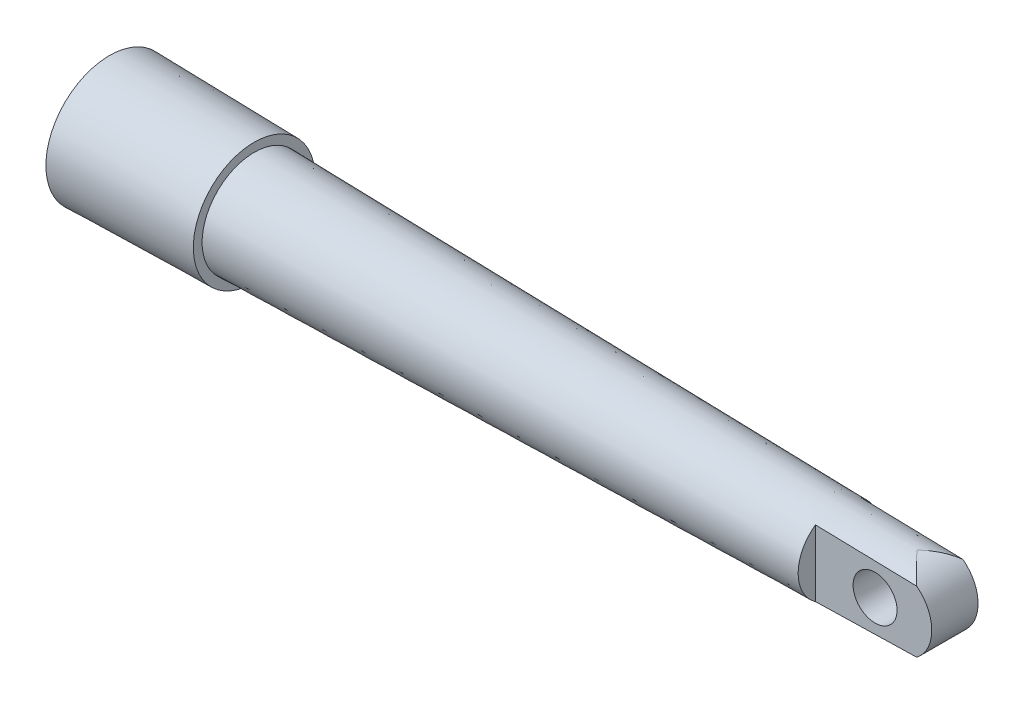
ISO-10303-21;
HEADER;
FILE_DESCRIPTION(('STEP AP214'),'2;1');
FILE_NAME('part.step','',(''),(''),'','','');
FILE_SCHEMA(('AUTOMOTIVE_DESIGN { 1 0 10303 214 1 1 1 1 }'));
ENDSEC;
DATA;
#1=APPLICATION_CONTEXT('core data for automotive mechanical design processes');
#2=APPLICATION_PROTOCOL_DEFINITION('international standard','automotive_design',2000,#1);
#3=PRODUCT_CONTEXT('',#1,'mechanical');
#4=PRODUCT('Part','Part','',(#3));
#5=PRODUCT_RELATED_PRODUCT_CATEGORY('part','',(#4));
#6=PRODUCT_DEFINITION_FORMATION('','',#4);
#7=PRODUCT_DEFINITION_CONTEXT('part definition',#1,'design');
#8=PRODUCT_DEFINITION('design','',#6,#7);
#9=PRODUCT_DEFINITION_SHAPE('','',#8);
#10=(LENGTH_UNIT() NAMED_UNIT(*) SI_UNIT(.MILLI.,.METRE.));
#11=(NAMED_UNIT(*) PLANE_ANGLE_UNIT() SI_UNIT($,.RADIAN.));
#12=(NAMED_UNIT(*) SI_UNIT($,.STERADIAN.) SOLID_ANGLE_UNIT());
#13=UNCERTAINTY_MEASURE_WITH_UNIT(LENGTH_MEASURE(1.E-05),#10,'distance_accuracy_value','');
#14=(GEOMETRIC_REPRESENTATION_CONTEXT(3) GLOBAL_UNCERTAINTY_ASSIGNED_CONTEXT((#13)) GLOBAL_UNIT_ASSIGNED_CONTEXT((#10,
#11,#12)) REPRESENTATION_CONTEXT('',''));
#15=CARTESIAN_POINT('',(0.,0.,0.));
#16=DIRECTION('',(0.,0.,1.));
#17=DIRECTION('',(1.,0.,0.));
#18=AXIS2_PLACEMENT_3D('',#15,#16,#17);
#19=CARTESIAN_POINT('',(174.200434656198,0.,5.));
#20=DIRECTION('',(0.,0.,-1.));
#21=DIRECTION('',(-1.,0.,0.));
#22=AXIS2_PLACEMENT_3D('',#19,#20,#21);
#23=CYLINDRICAL_SURFACE('',#22,8.41794246958896);
#24=CARTESIAN_POINT('',(179.366803439996,6.64608072559367,5.0002));
#25=CARTESIAN_POINT('',(179.259620876385,6.72939462139975,4.89298576343817));
#26=CARTESIAN_POINT('',(179.15121778174,6.80950832848228,4.78455001829458));
#27=CARTESIAN_POINT('',(178.932227068654,6.96346348707643,4.56549157156813));
#28=CARTESIAN_POINT('',(178.821639774893,7.03730586229762,4.4548691950252));
#29=CARTESIAN_POINT('',(178.487079278315,7.24956407380112,4.12019911741393));
#30=CARTESIAN_POINT('',(178.260171393543,7.37881592942518,3.89321236288996));
#31=CARTESIAN_POINT('',(177.801363349686,7.61322288873991,3.43423022190028));
#32=CARTESIAN_POINT('',(177.569488154344,7.7184768972235,3.20225986925533));
#33=CARTESIAN_POINT('',(177.101250731031,7.90636733326542,2.7337972823552));
#34=CARTESIAN_POINT('',(176.864889017503,7.98900633740341,2.49730556651675));
#35=CARTESIAN_POINT('',(176.43961571155,8.11702330295363,2.07174975260629));
#36=CARTESIAN_POINT('',(176.251320382807,8.16658860376487,1.88331260898278));
#37=CARTESIAN_POINT('',(175.873311813745,8.25232158124741,1.50488423674111));
#38=CARTESIAN_POINT('',(175.683598788161,8.28849124658635,1.31489324308571));
#39=CARTESIAN_POINT('',(175.297259563319,8.34853705658944,0.92781606930513));
#40=CARTESIAN_POINT('',(175.100602844277,8.37199297137441,0.730693944632489));
#41=CARTESIAN_POINT('',(174.824844994912,8.39513082891909,0.452540865957525));
#42=CARTESIAN_POINT('',(174.745433874348,8.40065380031897,0.372236261539609));
#43=CARTESIAN_POINT('',(174.625831059707,8.40728556893841,0.249265329173372));
#44=CARTESIAN_POINT('',(174.58518891933,8.40923877668969,0.207118522233076));
#45=CARTESIAN_POINT('',(174.524149916794,8.41174302874787,0.14076706652852));
#46=CARTESIAN_POINT('',(174.503030174873,8.41252599775226,0.117215222911022));
#47=CARTESIAN_POINT('',(174.472055028119,8.41356626360937,0.0784036573459711));
#48=CARTESIAN_POINT('',(174.461291683016,8.41390416527562,0.0639860149167651));
#49=CARTESIAN_POINT('',(174.449830312339,8.41424775595862,0.0436682692725535));
#50=CARTESIAN_POINT('',(174.44734618475,8.4143208275856,0.0388368240798795));
#51=CARTESIAN_POINT('',(174.443032102239,8.41444628863941,0.0288905928741298));
#52=CARTESIAN_POINT('',(174.441200278331,8.41449873720138,0.0237766656675212));
#53=CARTESIAN_POINT('',(174.438836485393,8.41456601034785,0.0144781546298814));
#54=CARTESIAN_POINT('',(174.438103551905,8.41458668149299,0.0103469902636856));
#55=CARTESIAN_POINT('',(174.437376768745,8.41460718158213,0.00202335230366073));
#56=CARTESIAN_POINT('',(174.437381556059,8.41460704896322,-0.00216899391449918));
#57=CARTESIAN_POINT('',(174.438122723688,8.41458613827413,-0.0104723514042981));
#58=CARTESIAN_POINT('',(174.438857065301,8.41456541773579,-0.0145835567703078));
#59=CARTESIAN_POINT('',(174.440921916264,8.41450666652898,-0.0226565569686138));
#60=CARTESIAN_POINT('',(174.442253894034,8.41446859322025,-0.0266179575697776));
#61=CARTESIAN_POINT('',(174.448105030095,8.41429926545655,-0.0413940451838804));
#62=CARTESIAN_POINT('',(174.454026262014,8.41412416787611,-0.0516213615028919));
#63=CARTESIAN_POINT('',(174.467034485339,8.41372247470663,-0.0713330370611939));
#64=CARTESIAN_POINT('',(174.474133087563,8.41349535662948,-0.0808084463831387));
#65=CARTESIAN_POINT('',(174.514657815897,8.41213981106812,-0.13258889336605));
#66=CARTESIAN_POINT('',(174.551926527026,8.41067871846851,-0.171796363214847));
#67=CARTESIAN_POINT('',(174.626444157955,8.40724364021028,-0.24958953422794));
#68=CARTESIAN_POINT('',(174.663692306371,8.40527216209481,-0.288177322106033));
#69=CARTESIAN_POINT('',(174.77586524311,8.39858017020571,-0.403323536696306));
#70=CARTESIAN_POINT('',(174.851328500491,8.39307853959255,-0.479381926215953));
#71=CARTESIAN_POINT('',(175.002233954241,8.38001611698356,-0.631336422771722));
#72=CARTESIAN_POINT('',(175.077676135822,8.37245465716117,-0.707232469116794));
#73=CARTESIAN_POINT('',(175.304322512078,8.34663338030185,-0.934935653003118));
#74=CARTESIAN_POINT('',(175.4555124713,8.32525640289347,-1.08642040076553));
#75=CARTESIAN_POINT('',(175.933483039656,8.24430007053753,-1.56517166582937));
#76=CARTESIAN_POINT('',(176.259106769756,8.1692626494769,-1.8911024028278));
#77=CARTESIAN_POINT('',(176.904678671959,7.97885339030716,-2.53713771585134));
#78=CARTESIAN_POINT('',(177.224624612471,7.86346604655091,-2.85724000230113));
#79=CARTESIAN_POINT('',(177.698024411462,7.65886698952587,-3.33084650398885));
#80=CARTESIAN_POINT('',(177.854911355188,7.5853133234466,-3.48779776945641));
#81=CARTESIAN_POINT('',(178.165959263709,7.42743465202846,-3.79896517150152));
#82=CARTESIAN_POINT('',(178.320120445948,7.34311051034524,-3.95318152625628));
#83=CARTESIAN_POINT('',(178.625315040644,7.1633504852728,-4.25848068881705));
#84=CARTESIAN_POINT('',(178.776346045375,7.06790639670477,-4.40956108457704));
#85=CARTESIAN_POINT('',(179.074598462207,6.86561794079729,-4.70790754928475));
#86=CARTESIAN_POINT('',(179.221818652435,6.75876997190451,-4.85517239485511));
#87=CARTESIAN_POINT('',(179.366803439996,6.64608072559368,-5.00019999999999));
#88=B_SPLINE_CURVE_WITH_KNOTS('',3,(#24,#25,#26,#27,#28,#29,#30,#31,#32,#33,#34,#35,#36,#37,#38,
#39,#40,#41,#42,#43,#44,#45,#46,#47,#48,#49,#50,#51,#52,#53,#54,#55,#56,#57,#58,#59,#60,#61,#62,
#63,#64,#65,#66,#67,#68,#69,#70,#71,#72,#73,#74,#75,#76,#77,#78,#79,#80,#81,#82,#83,#84,#85,#86,
#87),.UNSPECIFIED.,.F.,.F.,(4,2,2,2,2,2,2,2,2,2,2,2,2,2,2,2,2,2,2,2,2,2,2,2,2,2,2,2,2,2,2,4),
(0.,0.518870958801596,1.03766535965413,2.07459841268344,3.10717731854201,4.1396385312772,
4.95219239228514,5.76462557608318,6.60248834393434,6.94172070155679,7.11740483433382,
7.21237614199055,7.26609296600376,7.28236377254776,7.29858757743406,7.31111852431856,
7.32362631927253,7.33609925988377,7.3486030163793,7.3837617209358,7.4192903738709,
7.58118141317097,7.74229169101164,8.06402955937024,8.3858718642248,9.03098136231211,
10.429541653384,11.8286399741417,12.5297750168877,13.2308538727433,13.9324533561629,
14.6342750768479),.UNSPECIFIED.);
#89=CARTESIAN_POINT('',(179.366603499012,6.64623614603408,5.00000000000145));
#90=VERTEX_POINT('',#89);
#91=CARTESIAN_POINT('',(179.36660349901,6.64623614603521,-5.));
#92=VERTEX_POINT('',#91);
#93=EDGE_CURVE('E49',#90,#92,#88,.T.);
#94=ORIENTED_EDGE('',*,*,#93,.F.);
#95=CARTESIAN_POINT('',(174.200434656198,0.,5.));
#96=DIRECTION('',(0.,0.,1.));
#97=DIRECTION('',(-1.,0.,0.));
#98=AXIS2_PLACEMENT_3D('',#95,#96,#97);
#99=CIRCLE('',#98,8.41794246958896);
#100=CARTESIAN_POINT('',(179.36660349901,-6.6462361460352,5.));
#101=VERTEX_POINT('',#100);
#102=EDGE_CURVE('E107',#101,#90,#99,.T.);
#103=ORIENTED_EDGE('',*,*,#102,.F.);
#104=CARTESIAN_POINT('',(179.366803439996,-6.64608072559367,-5.0002));
#105=CARTESIAN_POINT('',(179.259620876385,-6.72939462139974,-4.89298576343817));
#106=CARTESIAN_POINT('',(179.15121778174,-6.80950832848227,-4.78455001829458));
#107=CARTESIAN_POINT('',(178.932227068654,-6.96346348707642,-4.56549157156814));
#108=CARTESIAN_POINT('',(178.821639774893,-7.0373058622976,-4.45486919502522));
#109=CARTESIAN_POINT('',(178.487079278315,-7.2495640738011,-4.12019911741395));
#110=CARTESIAN_POINT('',(178.260171393543,-7.37881592942516,-3.89321236288999));
#111=CARTESIAN_POINT('',(177.801363349686,-7.61322288873989,-3.43423022190032));
#112=CARTESIAN_POINT('',(177.569488154344,-7.71847689722348,-3.20225986925536));
#113=CARTESIAN_POINT('',(177.101250731031,-7.90636733326542,-2.73379728235522));
#114=CARTESIAN_POINT('',(176.864889017503,-7.98900633740341,-2.49730556651676));
#115=CARTESIAN_POINT('',(176.439615711544,-8.11702330295549,-2.07174975260012));
#116=CARTESIAN_POINT('',(176.251320382795,-8.16658860376813,-1.88331260897037));
#117=CARTESIAN_POINT('',(175.87331181372,-8.25232158125261,-1.50488423671615));
#118=CARTESIAN_POINT('',(175.68359878813,-8.28849124659209,-1.31489324305445));
#119=CARTESIAN_POINT('',(175.29725956329,-8.34853705659295,-0.927816069276641));
#120=CARTESIAN_POINT('',(175.100602844258,-8.37199297137625,-0.730693944613163));
#121=CARTESIAN_POINT('',(174.824844994904,-8.39513082891965,-0.452540865949615));
#122=CARTESIAN_POINT('',(174.745433874343,-8.40065380031932,-0.372236261533826));
#123=CARTESIAN_POINT('',(174.625831059704,-8.40728556893855,-0.249265329170245));
#124=CARTESIAN_POINT('',(174.585188919328,-8.40923877668978,-0.207118522230523));
#125=CARTESIAN_POINT('',(174.524149916792,-8.41174302874793,-0.140767066526929));
#126=CARTESIAN_POINT('',(174.503030174872,-8.41252599775231,-0.117215222909761));
#127=CARTESIAN_POINT('',(174.472055028119,-8.41356626360939,-0.0784036573449849));
#128=CARTESIAN_POINT('',(174.461291683015,-8.41390416527563,-0.0639860149157862));
#129=CARTESIAN_POINT('',(174.449830312339,-8.41424775595863,-0.0436682692717975));
#130=CARTESIAN_POINT('',(174.44734618475,-8.41432082758561,-0.038836824079214));
#131=CARTESIAN_POINT('',(174.443032102239,-8.41444628863941,-0.028890592873542));
#132=CARTESIAN_POINT('',(174.441200278331,-8.41449873720138,-0.0237766656669208));
#133=CARTESIAN_POINT('',(174.438836485393,-8.41456601034785,-0.0144781546292926));
#134=CARTESIAN_POINT('',(174.438103551905,-8.41458668149298,-0.0103469902630968));
#135=CARTESIAN_POINT('',(174.437376768746,-8.41460718158212,-0.0020233523030665));
#136=CARTESIAN_POINT('',(174.43738155606,-8.41460704896321,0.00216899391509886));
#137=CARTESIAN_POINT('',(174.438122723688,-8.41458613827412,0.0104723514049277));
#138=CARTESIAN_POINT('',(174.438857065301,-8.41456541773578,0.0145835567709619));
#139=CARTESIAN_POINT('',(174.440921916264,-8.41450666652898,0.02265655696928));
#140=CARTESIAN_POINT('',(174.442253894035,-8.41446859322025,0.0266179575704316));
#141=CARTESIAN_POINT('',(174.448105030096,-8.41429926545653,0.0413940451848976));
#142=CARTESIAN_POINT('',(174.454026262015,-8.41412416787608,0.0516213615042039));
#143=CARTESIAN_POINT('',(174.467034485341,-8.41372247470657,0.0713330370632448));
#144=CARTESIAN_POINT('',(174.474133087565,-8.41349535662942,0.0808084463856322));
#145=CARTESIAN_POINT('',(174.5146578159,-8.412139811068,0.132588893370765));
#146=CARTESIAN_POINT('',(174.551926527031,-8.41067871846829,0.171796363220818));
#147=CARTESIAN_POINT('',(174.626444157964,-8.40724364020984,0.249589534236728));
#148=CARTESIAN_POINT('',(174.663692306381,-8.40527216209425,0.288177322116378));
#149=CARTESIAN_POINT('',(174.775865243125,-8.39858017020473,0.403323536711294));
#150=CARTESIAN_POINT('',(174.851328500509,-8.3930785395912,0.479381926233949));
#151=CARTESIAN_POINT('',(175.002233954265,-8.3800161169813,0.631336422795774));
#152=CARTESIAN_POINT('',(175.077676135849,-8.37245465715837,0.707232469143893));
#153=CARTESIAN_POINT('',(175.304322512114,-8.34663338029717,0.934935653039459));
#154=CARTESIAN_POINT('',(175.455512471342,-8.32525640288719,1.08642040080804));
#155=CARTESIAN_POINT('',(175.933483039701,-8.24430007052799,1.56517166587413));
#156=CARTESIAN_POINT('',(176.259106769797,-8.16926264946646,1.89110240286867));
#157=CARTESIAN_POINT('',(176.904678671992,-7.97885339029579,2.53713771588447));
#158=CARTESIAN_POINT('',(177.2246246125,-7.86346604653949,2.85724000233039));
#159=CARTESIAN_POINT('',(177.698024411486,-7.65886698951522,3.33084650401206));
#160=CARTESIAN_POINT('',(177.854911355209,-7.58531332343644,3.4877977694774));
#161=CARTESIAN_POINT('',(178.165959263725,-7.42743465201955,3.79896517151812));
#162=CARTESIAN_POINT('',(178.320120445963,-7.34311051033708,3.95318152627072));
#163=CARTESIAN_POINT('',(178.625315040654,-7.16335048526646,4.25848068882723));
#164=CARTESIAN_POINT('',(178.776346045383,-7.06790639669949,4.4095610845851));
#165=CARTESIAN_POINT('',(179.074598462211,-6.86561794079441,4.7079075492887));
#166=CARTESIAN_POINT('',(179.221818652437,-6.75876997190299,4.85517239485707));
#167=CARTESIAN_POINT('',(179.366803439996,-6.64608072559366,5.00020000000001));
#168=B_SPLINE_CURVE_WITH_KNOTS('',3,(#104,#105,#106,#107,#108,#109,#110,#111,#112,#113,#114,
#115,#116,#117,#118,#119,#120,#121,#122,#123,#124,#125,#126,#127,#128,#129,#130,#131,#132,#133,
#134,#135,#136,#137,#138,#139,#140,#141,#142,#143,#144,#145,#146,#147,#148,#149,#150,#151,#152,
#153,#154,#155,#156,#157,#158,#159,#160,#161,#162,#163,#164,#165,#166,#167),.UNSPECIFIED.,.F.,
.F.,(4,2,2,2,2,2,2,2,2,2,2,2,2,2,2,2,2,2,2,2,2,2,2,2,2,2,2,2,2,2,2,4),(0.,0.518870958801591,
1.0376653596541,2.07459841268339,3.10717731854197,4.1396385312772,4.95219239231187,
5.76462557613664,6.60248834394841,6.94172070156193,7.11740483433632,7.2123761419918,
7.26609296600465,7.28236377254843,7.29858757743451,7.31111852431904,7.32362631927302,
7.33609925988429,7.34860301637983,7.38376172093774,7.41929037387437,7.58118141318107,
7.74229169102815,8.06402955939975,8.38587186426731,9.03098136238116,10.4295416534373,
11.8286399741792,12.5297750169158,13.2308538727621,13.9324533561721,14.6342750768478),.UNSPECIFIED.);
#169=CARTESIAN_POINT('',(179.36660349901,-6.64623614603521,-5.));
#170=VERTEX_POINT('',#169);
#171=EDGE_CURVE('E78',#170,#101,#168,.T.);
#172=ORIENTED_EDGE('',*,*,#171,.F.);
#173=CARTESIAN_POINT('',(174.200434656198,0.,-5.));
#174=DIRECTION('',(0.,0.,1.));
#175=DIRECTION('',(-1.,0.,0.));
#176=AXIS2_PLACEMENT_3D('',#173,#174,#175);
#177=CIRCLE('',#176,8.41794246958896);
#178=EDGE_CURVE('E83',#170,#92,#177,.T.);
#179=ORIENTED_EDGE('',*,*,#178,.T.);
#180=EDGE_LOOP('',(#94,#103,#172,#179));
#181=FACE_BOUND('',#180,.T.);
#182=ADVANCED_FACE('F33',(#181),#23,.T.);
#183=CARTESIAN_POINT('',(174.200434656198,0.,5.));
#184=DIRECTION('',(0.,0.,-1.));
#185=DIRECTION('',(-1.,0.,0.));
#186=AXIS2_PLACEMENT_3D('',#183,#184,#185);
#187=PLANE('',#186);
#188=CARTESIAN_POINT('',(170.368377125787,0.,5.));
#189=DIRECTION('',(0.,0.,1.));
#190=DIRECTION('',(1.,0.,0.));
#191=AXIS2_PLACEMENT_3D('',#188,#189,#190);
#192=CIRCLE('',#191,4.75);
#193=CARTESIAN_POINT('',(175.118377125787,0.,5.));
#194=VERTEX_POINT('',#193);
#195=EDGE_CURVE('E183',#194,#194,#192,.T.);
#196=ORIENTED_EDGE('',*,*,#195,.F.);
#197=EDGE_LOOP('',(#196));
#198=FACE_BOUND('',#197,.T.);
#199=CARTESIAN_POINT('',(143.620386068594,-7.5131755164153,5.));
#200=CARTESIAN_POINT('',(146.459216654679,-7.4456495044111,5.));
#201=CARTESIAN_POINT('',(149.298040658304,-7.37784630620775,5.));
#202=CARTESIAN_POINT('',(154.97567422518,-7.24163294133822,5.));
#203=CARTESIAN_POINT('',(157.814483788429,-7.17322277464566,5.));
#204=CARTESIAN_POINT('',(163.492086958253,-7.03574288245034,5.));
#205=CARTESIAN_POINT('',(166.330880564828,-6.96667315694623,5.));
#206=CARTESIAN_POINT('',(172.008450038264,-6.82781207334078,5.));
#207=CARTESIAN_POINT('',(174.847225905126,-6.75802071526119,5.));
#208=CARTESIAN_POINT('',(182.584603257201,-6.56672069814767,5.));
#209=CARTESIAN_POINT('',(187.483185485016,-6.44443142708481,5.));
#210=CARTESIAN_POINT('',(197.280279498378,-6.1970677290549,5.));
#211=CARTESIAN_POINT('',(202.178791283926,-6.07199330218287,5.));
#212=CARTESIAN_POINT('',(211.975731833362,-5.81851562167596,5.));
#213=CARTESIAN_POINT('',(216.8741605972,-5.69011236610296,5.));
#214=CARTESIAN_POINT('',(226.670909079756,-5.42917977386669,5.));
#215=CARTESIAN_POINT('',(231.569228798453,-5.29665043639243,5.));
#216=CARTESIAN_POINT('',(236.467481446118,-5.16165942084912,5.));
#217=B_SPLINE_CURVE_WITH_KNOTS('',3,(#199,#200,#201,#202,#203,#204,#205,#206,#207,#208,#209,
#210,#211,#212,#213,#214,#215,#216),.UNSPECIFIED.,.F.,.F.,(4,2,2,2,2,2,2,2,4),(0.,
8.51890073665628,17.0378018434508,25.5567029677891,34.0756038354551,48.7759283722273,
63.4762524075107,78.1765850017985,92.8769204854741),.UNSPECIFIED.);
#218=CARTESIAN_POINT('',(157.5,-7.18070330817253,5.));
#219=VERTEX_POINT('',#218);
#220=EDGE_CURVE('E73',#101,#219,#217,.F.);
#221=ORIENTED_EDGE('',*,*,#220,.F.);
#222=ORIENTED_EDGE('',*,*,#102,.T.);
#223=CARTESIAN_POINT('',(143.620386068594,7.51317551641531,5.));
#224=CARTESIAN_POINT('',(146.459216654679,7.44564950441111,5.));
#225=CARTESIAN_POINT('',(149.298040658304,7.37784630620776,5.));
#226=CARTESIAN_POINT('',(154.97567422518,7.24163294133822,5.));
#227=CARTESIAN_POINT('',(157.814483788429,7.17322277464566,5.));
#228=CARTESIAN_POINT('',(163.492086958253,7.03574288245035,5.));
#229=CARTESIAN_POINT('',(166.330880564828,6.96667315694623,5.));
#230=CARTESIAN_POINT('',(172.008450038264,6.82781207334078,5.));
#231=CARTESIAN_POINT('',(174.847225905126,6.75802071526119,5.));
#232=CARTESIAN_POINT('',(182.584603257201,6.56672069814767,5.));
#233=CARTESIAN_POINT('',(187.483185485016,6.44443142708481,5.));
#234=CARTESIAN_POINT('',(197.280279498378,6.1970677290549,5.));
#235=CARTESIAN_POINT('',(202.178791283926,6.07199330218287,5.));
#236=CARTESIAN_POINT('',(211.975731833362,5.81851562167595,5.));
#237=CARTESIAN_POINT('',(216.8741605972,5.69011236610296,5.));
#238=CARTESIAN_POINT('',(226.670909079756,5.42917977386669,5.));
#239=CARTESIAN_POINT('',(231.569228798453,5.29665043639242,5.));
#240=CARTESIAN_POINT('',(236.467481446118,5.16165942084912,5.));
#241=B_SPLINE_CURVE_WITH_KNOTS('',3,(#223,#224,#225,#226,#227,#228,#229,#230,#231,#232,#233,
#234,#235,#236,#237,#238,#239,#240),.UNSPECIFIED.,.F.,.F.,(4,2,2,2,2,2,2,2,4),(0.,
8.5189007366563,17.0378018434508,25.5567029677891,34.0756038354551,48.7759283722273,
63.4762524075107,78.1765850017984,92.8769204854741),.UNSPECIFIED.);
#242=CARTESIAN_POINT('',(157.5,7.18070330817253,5.));
#243=VERTEX_POINT('',#242);
#244=EDGE_CURVE('E92',#243,#90,#241,.T.);
#245=ORIENTED_EDGE('',*,*,#244,.F.);
#246=DIRECTION('',(0.,-1.,0.));
#247=VECTOR('',#246,1.);
#248=CARTESIAN_POINT('',(157.5,8.75,5.));
#249=LINE('',#248,#247);
#250=EDGE_CURVE('E87',#243,#219,#249,.T.);
#251=ORIENTED_EDGE('',*,*,#250,.T.);
#252=EDGE_LOOP('',(#221,#222,#245,#251));
#253=FACE_BOUND('',#252,.T.);
#254=ADVANCED_FACE('F91',(#198,#253),#187,.F.);
#255=CARTESIAN_POINT('',(174.200434656198,0.,-5.));
#256=DIRECTION('',(0.,0.,-1.));
#257=DIRECTION('',(-1.,0.,0.));
#258=AXIS2_PLACEMENT_3D('',#255,#256,#257);
#259=PLANE('',#258);
#260=CARTESIAN_POINT('',(170.368377125787,0.,-5.));
#261=DIRECTION('',(0.,0.,-1.));
#262=DIRECTION('',(-1.,0.,0.));
#263=AXIS2_PLACEMENT_3D('',#260,#261,#262);
#264=CIRCLE('',#263,4.75);
#265=CARTESIAN_POINT('',(165.618377125787,0.,-5.));
#266=VERTEX_POINT('',#265);
#267=EDGE_CURVE('E37',#266,#266,#264,.T.);
#268=ORIENTED_EDGE('',*,*,#267,.F.);
#269=EDGE_LOOP('',(#268));
#270=FACE_BOUND('',#269,.T.);
#271=ORIENTED_EDGE('',*,*,#178,.F.);
#272=CARTESIAN_POINT('',(143.620386068594,-7.5131755164153,-5.));
#273=CARTESIAN_POINT('',(146.459216654679,-7.4456495044111,-5.));
#274=CARTESIAN_POINT('',(149.298040658304,-7.37784630620775,-5.));
#275=CARTESIAN_POINT('',(154.97567422518,-7.24163294133822,-5.));
#276=CARTESIAN_POINT('',(157.814483788429,-7.17322277464566,-5.));
#277=CARTESIAN_POINT('',(163.492086958253,-7.03574288245034,-5.));
#278=CARTESIAN_POINT('',(166.330880564828,-6.96667315694623,-5.));
#279=CARTESIAN_POINT('',(172.008450038264,-6.82781207334078,-5.));
#280=CARTESIAN_POINT('',(174.847225905126,-6.75802071526119,-5.));
#281=CARTESIAN_POINT('',(182.584603257201,-6.56672069814767,-5.));
#282=CARTESIAN_POINT('',(187.483185485016,-6.44443142708481,-5.));
#283=CARTESIAN_POINT('',(197.280279498378,-6.1970677290549,-5.));
#284=CARTESIAN_POINT('',(202.178791283926,-6.07199330218287,-5.));
#285=CARTESIAN_POINT('',(211.975731833362,-5.81851562167596,-5.));
#286=CARTESIAN_POINT('',(216.8741605972,-5.69011236610296,-5.));
#287=CARTESIAN_POINT('',(226.670909079756,-5.42917977386669,-5.));
#288=CARTESIAN_POINT('',(231.569228798453,-5.29665043639243,-5.));
#289=CARTESIAN_POINT('',(236.467481446118,-5.16165942084912,-5.));
#290=B_SPLINE_CURVE_WITH_KNOTS('',3,(#272,#273,#274,#275,#276,#277,#278,#279,#280,#281,#282,
#283,#284,#285,#286,#287,#288,#289),.UNSPECIFIED.,.F.,.F.,(4,2,2,2,2,2,2,2,4),(0.,
8.51890073665628,17.0378018434508,25.5567029677891,34.0756038354551,48.7759283722273,
63.4762524075107,78.1765850017985,92.8769204854741),.UNSPECIFIED.);
#291=CARTESIAN_POINT('',(157.5,-7.18070330817254,-5.));
#292=VERTEX_POINT('',#291);
#293=EDGE_CURVE('E11',#170,#292,#290,.F.);
#294=ORIENTED_EDGE('',*,*,#293,.T.);
#295=DIRECTION('',(0.,-1.,0.));
#296=VECTOR('',#295,1.);
#297=CARTESIAN_POINT('',(157.5,8.75,-5.));
#298=LINE('',#297,#296);
#299=CARTESIAN_POINT('',(157.5,7.18070330817253,-5.));
#300=VERTEX_POINT('',#299);
#301=EDGE_CURVE('E93',#300,#292,#298,.T.);
#302=ORIENTED_EDGE('',*,*,#301,.F.);
#303=CARTESIAN_POINT('',(143.620386068594,7.51317551641531,-5.));
#304=CARTESIAN_POINT('',(146.459216654679,7.44564950441111,-5.));
#305=CARTESIAN_POINT('',(149.298040658304,7.37784630620776,-5.));
#306=CARTESIAN_POINT('',(154.97567422518,7.24163294133822,-5.));
#307=CARTESIAN_POINT('',(157.814483788429,7.17322277464566,-5.));
#308=CARTESIAN_POINT('',(163.492086958253,7.03574288245035,-5.));
#309=CARTESIAN_POINT('',(166.330880564828,6.96667315694623,-5.));
#310=CARTESIAN_POINT('',(172.008450038264,6.82781207334078,-5.));
#311=CARTESIAN_POINT('',(174.847225905126,6.75802071526119,-5.));
#312=CARTESIAN_POINT('',(182.584603257201,6.56672069814767,-5.));
#313=CARTESIAN_POINT('',(187.483185485016,6.44443142708481,-5.));
#314=CARTESIAN_POINT('',(197.280279498378,6.1970677290549,-5.));
#315=CARTESIAN_POINT('',(202.178791283926,6.07199330218287,-5.));
#316=CARTESIAN_POINT('',(211.975731833362,5.81851562167595,-5.));
#317=CARTESIAN_POINT('',(216.8741605972,5.69011236610296,-5.));
#318=CARTESIAN_POINT('',(226.670909079756,5.42917977386669,-5.));
#319=CARTESIAN_POINT('',(231.569228798453,5.29665043639242,-5.));
#320=CARTESIAN_POINT('',(236.467481446118,5.16165942084912,-5.));
#321=B_SPLINE_CURVE_WITH_KNOTS('',3,(#303,#304,#305,#306,#307,#308,#309,#310,#311,#312,#313,
#314,#315,#316,#317,#318,#319,#320),.UNSPECIFIED.,.F.,.F.,(4,2,2,2,2,2,2,2,4),(0.,
8.5189007366563,17.0378018434508,25.5567029677891,34.0756038354551,48.7759283722273,
63.4762524075107,78.1765850017984,92.8769204854741),.UNSPECIFIED.);
#322=EDGE_CURVE('E42',#300,#92,#321,.T.);
#323=ORIENTED_EDGE('',*,*,#322,.T.);
#324=EDGE_LOOP('',(#271,#294,#302,#323));
#325=FACE_BOUND('',#324,.T.);
#326=ADVANCED_FACE('F123',(#270,#325),#259,.T.);
#327=CARTESIAN_POINT('',(157.5,8.75,0.));
#328=DIRECTION('',(1.,0.,0.));
#329=DIRECTION('',(0.,0.,-1.));
#330=AXIS2_PLACEMENT_3D('',#327,#328,#329);
#331=PLANE('',#330);
#332=CARTESIAN_POINT('',(157.5,0.,0.));
#333=DIRECTION('',(1.,0.,0.));
#334=DIRECTION('',(0.,0.,-1.));
#335=AXIS2_PLACEMENT_3D('',#332,#333,#334);
#336=CIRCLE('',#335,8.75);
#337=EDGE_CURVE('E89',#292,#300,#336,.T.);
#338=ORIENTED_EDGE('',*,*,#337,.T.);
#339=ORIENTED_EDGE('',*,*,#301,.T.);
#340=EDGE_LOOP('',(#338,#339));
#341=FACE_BOUND('',#340,.T.);
#342=ADVANCED_FACE('F169',(#341),#331,.T.);
#343=ORIENTED_EDGE('',*,*,#250,.F.);
#344=EDGE_CURVE('E76',#243,#219,#336,.T.);
#345=ORIENTED_EDGE('',*,*,#344,.T.);
#346=EDGE_LOOP('',(#343,#345));
#347=FACE_BOUND('',#346,.T.);
#348=ADVANCED_FACE('F35',(#347),#331,.T.);
#349=CARTESIAN_POINT('',(0.,0.,0.));
#350=DIRECTION('',(-1.,0.,0.));
#351=DIRECTION('',(0.,0.,1.));
#352=AXIS2_PLACEMENT_3D('',#349,#350,#351);
#353=PLANE('',#352);
#354=CARTESIAN_POINT('',(0.,0.,0.));
#355=DIRECTION('',(-1.,0.,0.));
#356=DIRECTION('',(0.,0.,1.));
#357=AXIS2_PLACEMENT_3D('',#354,#355,#356);
#358=CIRCLE('',#357,5.);
#359=CARTESIAN_POINT('',(0.,0.,5.));
#360=VERTEX_POINT('',#359);
#361=EDGE_CURVE('E173',#360,#360,#358,.T.);
#362=ORIENTED_EDGE('',*,*,#361,.F.);
#363=EDGE_LOOP('',(#362));
#364=FACE_BOUND('',#363,.T.);
#365=CARTESIAN_POINT('',(0.,0.,0.));
#366=DIRECTION('',(1.,0.,0.));
#367=DIRECTION('',(0.,0.,-1.));
#368=AXIS2_PLACEMENT_3D('',#365,#366,#367);
#369=CIRCLE('',#368,13.75);
#370=CARTESIAN_POINT('',(0.,0.,-13.75));
#371=VERTEX_POINT('',#370);
#372=EDGE_CURVE('E94',#371,#371,#369,.T.);
#373=ORIENTED_EDGE('',*,*,#372,.F.);
#374=EDGE_LOOP('',(#373));
#375=FACE_BOUND('',#374,.T.);
#376=ADVANCED_FACE('F162',(#364,#375),#353,.T.);
#377=CARTESIAN_POINT('',(31.25,0.,0.));
#378=DIRECTION('',(-1.,0.,0.));
#379=DIRECTION('',(0.,0.,1.));
#380=AXIS2_PLACEMENT_3D('',#377,#378,#379);
#381=CONICAL_SURFACE('',#380,13.15,0.0191976412257015);
#382=ORIENTED_EDGE('',*,*,#372,.T.);
#383=EDGE_LOOP('',(#382));
#384=FACE_BOUND('',#383,.T.);
#385=CARTESIAN_POINT('',(31.25,0.,0.));
#386=DIRECTION('',(1.,0.,0.));
#387=DIRECTION('',(0.,0.,-1.));
#388=AXIS2_PLACEMENT_3D('',#385,#386,#387);
#389=CIRCLE('',#388,13.15);
#390=CARTESIAN_POINT('',(31.25,0.,-13.15));
#391=VERTEX_POINT('',#390);
#392=EDGE_CURVE('E98',#391,#391,#389,.T.);
#393=ORIENTED_EDGE('',*,*,#392,.F.);
#394=EDGE_LOOP('',(#393));
#395=FACE_BOUND('',#394,.T.);
#396=ADVANCED_FACE('F159',(#384,#395),#381,.T.);
#397=CARTESIAN_POINT('',(31.25,13.15,0.));
#398=DIRECTION('',(1.,0.,0.));
#399=DIRECTION('',(0.,0.,-1.));
#400=AXIS2_PLACEMENT_3D('',#397,#398,#399);
#401=PLANE('',#400);
#402=ORIENTED_EDGE('',*,*,#392,.T.);
#403=EDGE_LOOP('',(#402));
#404=FACE_BOUND('',#403,.T.);
#405=CARTESIAN_POINT('',(31.25,0.,0.));
#406=DIRECTION('',(1.,0.,0.));
#407=DIRECTION('',(0.,0.,-1.));
#408=AXIS2_PLACEMENT_3D('',#405,#406,#407);
#409=CIRCLE('',#408,11.25);
#410=CARTESIAN_POINT('',(31.25,0.,-11.25));
#411=VERTEX_POINT('',#410);
#412=EDGE_CURVE('E88',#411,#411,#409,.T.);
#413=ORIENTED_EDGE('',*,*,#412,.F.);
#414=EDGE_LOOP('',(#413));
#415=FACE_BOUND('',#414,.T.);
#416=ADVANCED_FACE('F155',(#404,#415),#401,.T.);
#417=CARTESIAN_POINT('',(157.5,0.,0.));
#418=DIRECTION('',(-1.,0.,0.));
#419=DIRECTION('',(0.,0.,1.));
#420=AXIS2_PLACEMENT_3D('',#417,#418,#419);
#421=CONICAL_SURFACE('',#420,8.75,0.0197993925663927);
#422=ORIENTED_EDGE('',*,*,#412,.T.);
#423=EDGE_LOOP('',(#422));
#424=FACE_BOUND('',#423,.T.);
#425=ORIENTED_EDGE('',*,*,#322,.F.);
#426=ORIENTED_EDGE('',*,*,#337,.F.);
#427=ORIENTED_EDGE('',*,*,#293,.F.);
#428=ORIENTED_EDGE('',*,*,#171,.T.);
#429=ORIENTED_EDGE('',*,*,#220,.T.);
#430=ORIENTED_EDGE('',*,*,#344,.F.);
#431=ORIENTED_EDGE('',*,*,#244,.T.);
#432=ORIENTED_EDGE('',*,*,#93,.T.);
#433=EDGE_LOOP('',(#425,#426,#427,#428,#429,#430,#431,#432));
#434=FACE_BOUND('',#433,.T.);
#435=ADVANCED_FACE('F75',(#424,#434),#421,.T.);
#436=CARTESIAN_POINT('',(170.368377125787,0.,-13.75));
#437=DIRECTION('',(0.,0.,1.));
#438=DIRECTION('',(1.,0.,0.));
#439=AXIS2_PLACEMENT_3D('',#436,#437,#438);
#440=CYLINDRICAL_SURFACE('',#439,4.75);
#441=ORIENTED_EDGE('',*,*,#267,.T.);
#442=EDGE_LOOP('',(#441));
#443=FACE_BOUND('',#442,.T.);
#444=ORIENTED_EDGE('',*,*,#195,.T.);
#445=EDGE_LOOP('',(#444));
#446=FACE_BOUND('',#445,.T.);
#447=ADVANCED_FACE('F128',(#443,#446),#440,.F.);
#448=CARTESIAN_POINT('',(132.5,0.,0.));
#449=DIRECTION('',(-1.,0.,0.));
#450=DIRECTION('',(0.,0.,1.));
#451=AXIS2_PLACEMENT_3D('',#448,#449,#450);
#452=CYLINDRICAL_SURFACE('',#451,5.);
#453=CARTESIAN_POINT('',(132.5,0.,0.));
#454=DIRECTION('',(-1.,0.,0.));
#455=DIRECTION('',(0.,0.,1.));
#456=AXIS2_PLACEMENT_3D('',#453,#454,#455);
#457=CIRCLE('',#456,5.);
#458=CARTESIAN_POINT('',(132.5,0.,5.));
#459=VERTEX_POINT('',#458);
#460=EDGE_CURVE('E180',#459,#459,#457,.T.);
#461=ORIENTED_EDGE('',*,*,#460,.F.);
#462=EDGE_LOOP('',(#461));
#463=FACE_BOUND('',#462,.T.);
#464=ORIENTED_EDGE('',*,*,#361,.T.);
#465=EDGE_LOOP('',(#464));
#466=FACE_BOUND('',#465,.T.);
#467=ADVANCED_FACE('F241',(#463,#466),#452,.F.);
#468=CARTESIAN_POINT('',(132.5,0.,0.));
#469=DIRECTION('',(-1.,0.,0.));
#470=DIRECTION('',(0.,0.,1.));
#471=AXIS2_PLACEMENT_3D('',#468,#469,#470);
#472=PLANE('',#471);
#473=ORIENTED_EDGE('',*,*,#460,.T.);
#474=EDGE_LOOP('',(#473));
#475=FACE_BOUND('',#474,.T.);
#476=ADVANCED_FACE('F246',(#475),#472,.T.);
#477=CLOSED_SHELL('',(#182,#254,#326,#342,#348,#376,#396,#416,#435,#447,#467,#476));
#478=MANIFOLD_SOLID_BREP('B2',#477);
#479=ADVANCED_BREP_SHAPE_REPRESENTATION('',(#18,#478),#14);
#480=SHAPE_DEFINITION_REPRESENTATION(#9,#479);
ENDSEC;
END-ISO-10303-21;
